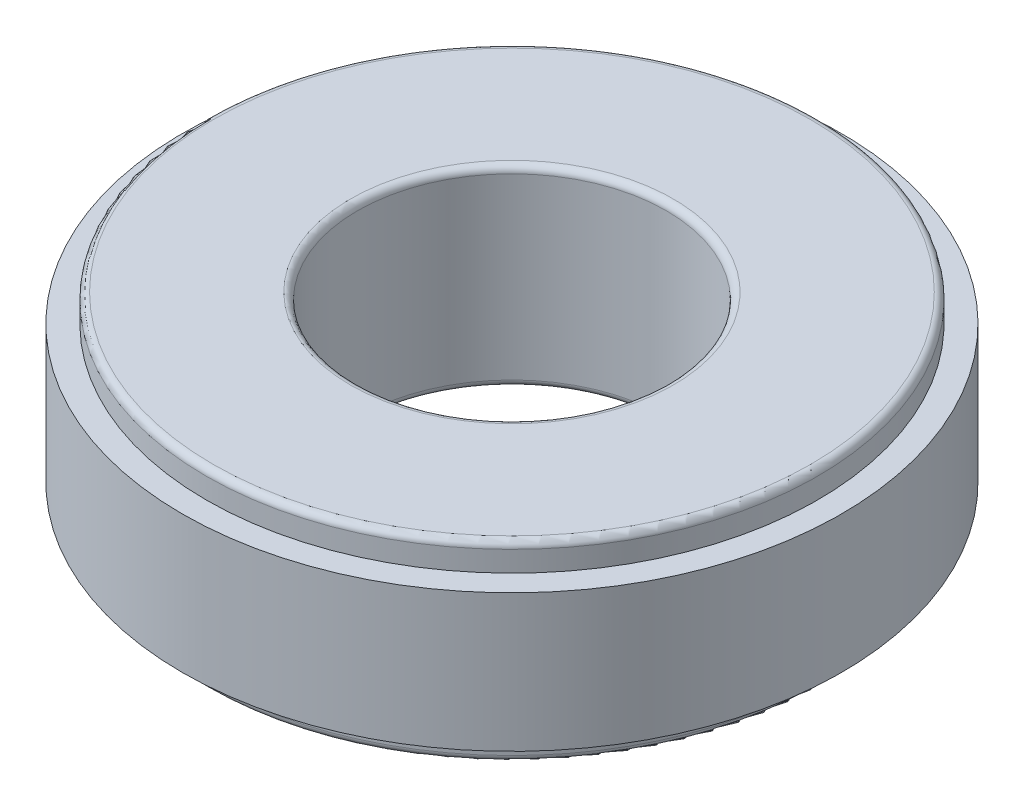
ISO-10303-21;
HEADER;
FILE_DESCRIPTION(('STEP AP214'),'2;1');
FILE_NAME('part.step','',(''),(''),'','','');
FILE_SCHEMA(('AUTOMOTIVE_DESIGN { 1 0 10303 214 1 1 1 1 }'));
ENDSEC;
DATA;
#1=APPLICATION_CONTEXT('core data for automotive mechanical design processes');
#2=APPLICATION_PROTOCOL_DEFINITION('international standard','automotive_design',2000,#1);
#3=PRODUCT_CONTEXT('',#1,'mechanical');
#4=PRODUCT('Part','Part','',(#3));
#5=PRODUCT_RELATED_PRODUCT_CATEGORY('part','',(#4));
#6=PRODUCT_DEFINITION_FORMATION('','',#4);
#7=PRODUCT_DEFINITION_CONTEXT('part definition',#1,'design');
#8=PRODUCT_DEFINITION('design','',#6,#7);
#9=PRODUCT_DEFINITION_SHAPE('','',#8);
#10=(LENGTH_UNIT() NAMED_UNIT(*) SI_UNIT(.MILLI.,.METRE.));
#11=(NAMED_UNIT(*) PLANE_ANGLE_UNIT() SI_UNIT($,.RADIAN.));
#12=(NAMED_UNIT(*) SI_UNIT($,.STERADIAN.) SOLID_ANGLE_UNIT());
#13=UNCERTAINTY_MEASURE_WITH_UNIT(LENGTH_MEASURE(1.E-05),#10,'distance_accuracy_value','');
#14=(GEOMETRIC_REPRESENTATION_CONTEXT(3) GLOBAL_UNCERTAINTY_ASSIGNED_CONTEXT((#13)) GLOBAL_UNIT_ASSIGNED_CONTEXT((#10,
#11,#12)) REPRESENTATION_CONTEXT('',''));
#15=CARTESIAN_POINT('',(0.,0.,0.));
#16=DIRECTION('',(0.,0.,1.));
#17=DIRECTION('',(1.,0.,0.));
#18=AXIS2_PLACEMENT_3D('',#15,#16,#17);
#19=CARTESIAN_POINT('',(0.,2.54,0.));
#20=DIRECTION('',(0.,-1.,0.));
#21=DIRECTION('',(0.,0.,-1.));
#22=AXIS2_PLACEMENT_3D('',#19,#20,#21);
#23=CYLINDRICAL_SURFACE('',#22,28.2575);
#24=CARTESIAN_POINT('',(0.,0.635,0.));
#25=DIRECTION('',(0.,1.,0.));
#26=DIRECTION('',(0.,0.,1.));
#27=AXIS2_PLACEMENT_3D('',#24,#25,#26);
#28=CIRCLE('',#27,28.2575);
#29=CARTESIAN_POINT('',(0.,0.635,28.2575));
#30=VERTEX_POINT('',#29);
#31=EDGE_CURVE('E10',#30,#30,#28,.T.);
#32=ORIENTED_EDGE('',*,*,#31,.T.);
#33=EDGE_LOOP('',(#32));
#34=FACE_BOUND('',#33,.T.);
#35=CARTESIAN_POINT('',(0.,2.54,0.));
#36=DIRECTION('',(0.,1.,0.));
#37=DIRECTION('',(0.,0.,1.));
#38=AXIS2_PLACEMENT_3D('',#35,#36,#37);
#39=CIRCLE('',#38,28.2575);
#40=CARTESIAN_POINT('',(0.,2.54,28.2575));
#41=VERTEX_POINT('',#40);
#42=EDGE_CURVE('E64',#41,#41,#39,.T.);
#43=ORIENTED_EDGE('',*,*,#42,.F.);
#44=EDGE_LOOP('',(#43));
#45=FACE_BOUND('',#44,.T.);
#46=ADVANCED_FACE('F31',(#34,#45),#23,.T.);
#47=CARTESIAN_POINT('',(0.,0.,0.));
#48=DIRECTION('',(0.,1.,0.));
#49=DIRECTION('',(0.,0.,1.));
#50=AXIS2_PLACEMENT_3D('',#47,#48,#49);
#51=PLANE('',#50);
#52=CARTESIAN_POINT('',(0.,0.,0.));
#53=DIRECTION('',(0.,1.,0.));
#54=DIRECTION('',(0.,0.,1.));
#55=AXIS2_PLACEMENT_3D('',#52,#53,#54);
#56=CIRCLE('',#55,14.9225);
#57=CARTESIAN_POINT('',(0.,0.,14.9225));
#58=VERTEX_POINT('',#57);
#59=EDGE_CURVE('E57',#58,#58,#56,.T.);
#60=ORIENTED_EDGE('',*,*,#59,.T.);
#61=EDGE_LOOP('',(#60));
#62=FACE_BOUND('',#61,.T.);
#63=CARTESIAN_POINT('',(0.,0.,0.));
#64=DIRECTION('',(0.,1.,0.));
#65=DIRECTION('',(0.,0.,1.));
#66=AXIS2_PLACEMENT_3D('',#63,#64,#65);
#67=CIRCLE('',#66,27.6225);
#68=CARTESIAN_POINT('',(0.,0.,27.6225));
#69=VERTEX_POINT('',#68);
#70=EDGE_CURVE('E60',#69,#69,#67,.F.);
#71=ORIENTED_EDGE('',*,*,#70,.T.);
#72=EDGE_LOOP('',(#71));
#73=FACE_BOUND('',#72,.T.);
#74=ADVANCED_FACE('F88',(#62,#73),#51,.F.);
#75=CARTESIAN_POINT('',(0.,15.24,0.));
#76=DIRECTION('',(0.,-1.,0.));
#77=DIRECTION('',(0.,0.,-1.));
#78=AXIS2_PLACEMENT_3D('',#75,#76,#77);
#79=CYLINDRICAL_SURFACE('',#78,30.48);
#80=CARTESIAN_POINT('',(0.,15.24,0.));
#81=DIRECTION('',(0.,1.,0.));
#82=DIRECTION('',(0.,0.,1.));
#83=AXIS2_PLACEMENT_3D('',#80,#81,#82);
#84=CIRCLE('',#83,30.48);
#85=CARTESIAN_POINT('',(0.,15.24,30.48));
#86=VERTEX_POINT('',#85);
#87=EDGE_CURVE('E67',#86,#86,#84,.T.);
#88=ORIENTED_EDGE('',*,*,#87,.F.);
#89=EDGE_LOOP('',(#88));
#90=FACE_BOUND('',#89,.T.);
#91=CARTESIAN_POINT('',(0.,2.54,0.));
#92=DIRECTION('',(0.,1.,0.));
#93=DIRECTION('',(0.,0.,1.));
#94=AXIS2_PLACEMENT_3D('',#91,#92,#93);
#95=CIRCLE('',#94,30.48);
#96=CARTESIAN_POINT('',(0.,2.54,30.48));
#97=VERTEX_POINT('',#96);
#98=EDGE_CURVE('E68',#97,#97,#95,.T.);
#99=ORIENTED_EDGE('',*,*,#98,.T.);
#100=EDGE_LOOP('',(#99));
#101=FACE_BOUND('',#100,.T.);
#102=ADVANCED_FACE('F82',(#90,#101),#79,.T.);
#103=CARTESIAN_POINT('',(0.,15.24,0.));
#104=DIRECTION('',(0.,1.,0.));
#105=DIRECTION('',(0.,0.,1.));
#106=AXIS2_PLACEMENT_3D('',#103,#104,#105);
#107=PLANE('',#106);
#108=CARTESIAN_POINT('',(0.,15.24,0.));
#109=DIRECTION('',(0.,1.,0.));
#110=DIRECTION('',(0.,0.,1.));
#111=AXIS2_PLACEMENT_3D('',#108,#109,#110);
#112=CIRCLE('',#111,28.2575);
#113=CARTESIAN_POINT('',(0.,15.24,28.2575));
#114=VERTEX_POINT('',#113);
#115=EDGE_CURVE('E63',#114,#114,#112,.T.);
#116=ORIENTED_EDGE('',*,*,#115,.F.);
#117=EDGE_LOOP('',(#116));
#118=FACE_BOUND('',#117,.T.);
#119=ORIENTED_EDGE('',*,*,#87,.T.);
#120=EDGE_LOOP('',(#119));
#121=FACE_BOUND('',#120,.T.);
#122=ADVANCED_FACE('F78',(#118,#121),#107,.T.);
#123=CARTESIAN_POINT('',(0.,2.54,0.));
#124=DIRECTION('',(0.,1.,0.));
#125=DIRECTION('',(0.,0.,1.));
#126=AXIS2_PLACEMENT_3D('',#123,#124,#125);
#127=PLANE('',#126);
#128=ORIENTED_EDGE('',*,*,#42,.T.);
#129=EDGE_LOOP('',(#128));
#130=FACE_BOUND('',#129,.T.);
#131=ORIENTED_EDGE('',*,*,#98,.F.);
#132=EDGE_LOOP('',(#131));
#133=FACE_BOUND('',#132,.T.);
#134=ADVANCED_FACE('F81',(#130,#133),#127,.F.);
#135=CARTESIAN_POINT('',(0.,17.78,0.));
#136=DIRECTION('',(0.,-1.,0.));
#137=DIRECTION('',(0.,0.,-1.));
#138=AXIS2_PLACEMENT_3D('',#135,#136,#137);
#139=CYLINDRICAL_SURFACE('',#138,28.2575);
#140=CARTESIAN_POINT('',(0.,17.145,0.));
#141=DIRECTION('',(0.,1.,0.));
#142=DIRECTION('',(0.,0.,1.));
#143=AXIS2_PLACEMENT_3D('',#140,#141,#142);
#144=CIRCLE('',#143,28.2575);
#145=CARTESIAN_POINT('',(0.,17.145,28.2575));
#146=VERTEX_POINT('',#145);
#147=EDGE_CURVE('E38',#146,#146,#144,.F.);
#148=ORIENTED_EDGE('',*,*,#147,.T.);
#149=EDGE_LOOP('',(#148));
#150=FACE_BOUND('',#149,.T.);
#151=ORIENTED_EDGE('',*,*,#115,.T.);
#152=EDGE_LOOP('',(#151));
#153=FACE_BOUND('',#152,.T.);
#154=ADVANCED_FACE('F76',(#150,#153),#139,.T.);
#155=CARTESIAN_POINT('',(0.,17.78,0.));
#156=DIRECTION('',(0.,1.,0.));
#157=DIRECTION('',(0.,0.,1.));
#158=AXIS2_PLACEMENT_3D('',#155,#156,#157);
#159=PLANE('',#158);
#160=CARTESIAN_POINT('',(0.,17.78,0.));
#161=DIRECTION('',(0.,1.,0.));
#162=DIRECTION('',(0.,0.,1.));
#163=AXIS2_PLACEMENT_3D('',#160,#161,#162);
#164=CIRCLE('',#163,14.9225);
#165=CARTESIAN_POINT('',(0.,17.78,14.9225));
#166=VERTEX_POINT('',#165);
#167=EDGE_CURVE('E42',#166,#166,#164,.F.);
#168=ORIENTED_EDGE('',*,*,#167,.T.);
#169=EDGE_LOOP('',(#168));
#170=FACE_BOUND('',#169,.T.);
#171=CARTESIAN_POINT('',(0.,17.78,0.));
#172=DIRECTION('',(0.,1.,0.));
#173=DIRECTION('',(0.,0.,1.));
#174=AXIS2_PLACEMENT_3D('',#171,#172,#173);
#175=CIRCLE('',#174,27.6225);
#176=CARTESIAN_POINT('',(0.,17.78,27.6225));
#177=VERTEX_POINT('',#176);
#178=EDGE_CURVE('E46',#177,#177,#175,.T.);
#179=ORIENTED_EDGE('',*,*,#178,.T.);
#180=EDGE_LOOP('',(#179));
#181=FACE_BOUND('',#180,.T.);
#182=ADVANCED_FACE('F98',(#170,#181),#159,.T.);
#183=CARTESIAN_POINT('',(0.,0.,0.));
#184=DIRECTION('',(0.,1.,0.));
#185=DIRECTION('',(0.,0.,1.));
#186=AXIS2_PLACEMENT_3D('',#183,#184,#185);
#187=CYLINDRICAL_SURFACE('',#186,14.2875);
#188=CARTESIAN_POINT('',(0.,0.635,0.));
#189=DIRECTION('',(0.,1.,0.));
#190=DIRECTION('',(0.,0.,1.));
#191=AXIS2_PLACEMENT_3D('',#188,#189,#190);
#192=CIRCLE('',#191,14.2875);
#193=CARTESIAN_POINT('',(0.,0.635,14.2875));
#194=VERTEX_POINT('',#193);
#195=EDGE_CURVE('E51',#194,#194,#192,.F.);
#196=ORIENTED_EDGE('',*,*,#195,.T.);
#197=EDGE_LOOP('',(#196));
#198=FACE_BOUND('',#197,.T.);
#199=CARTESIAN_POINT('',(0.,17.145,0.));
#200=DIRECTION('',(0.,1.,0.));
#201=DIRECTION('',(0.,0.,1.));
#202=AXIS2_PLACEMENT_3D('',#199,#200,#201);
#203=CIRCLE('',#202,14.2875);
#204=CARTESIAN_POINT('',(0.,17.145,14.2875));
#205=VERTEX_POINT('',#204);
#206=EDGE_CURVE('E54',#205,#205,#203,.T.);
#207=ORIENTED_EDGE('',*,*,#206,.T.);
#208=EDGE_LOOP('',(#207));
#209=FACE_BOUND('',#208,.T.);
#210=ADVANCED_FACE('F113',(#198,#209),#187,.F.);
#211=CARTESIAN_POINT('',(0.,0.635,0.));
#212=DIRECTION('',(0.,1.,0.));
#213=DIRECTION('',(0.,0.,1.));
#214=AXIS2_PLACEMENT_3D('',#211,#212,#213);
#215=TOROIDAL_SURFACE('',#214,14.9225,0.635);
#216=ORIENTED_EDGE('',*,*,#195,.F.);
#217=EDGE_LOOP('',(#216));
#218=FACE_BOUND('',#217,.T.);
#219=ORIENTED_EDGE('',*,*,#59,.F.);
#220=EDGE_LOOP('',(#219));
#221=FACE_BOUND('',#220,.T.);
#222=ADVANCED_FACE('F109',(#218,#221),#215,.T.);
#223=CARTESIAN_POINT('',(0.,17.145,0.));
#224=DIRECTION('',(0.,1.,0.));
#225=DIRECTION('',(0.,0.,1.));
#226=AXIS2_PLACEMENT_3D('',#223,#224,#225);
#227=TOROIDAL_SURFACE('',#226,14.9225,0.635);
#228=ORIENTED_EDGE('',*,*,#167,.F.);
#229=EDGE_LOOP('',(#228));
#230=FACE_BOUND('',#229,.T.);
#231=ORIENTED_EDGE('',*,*,#206,.F.);
#232=EDGE_LOOP('',(#231));
#233=FACE_BOUND('',#232,.T.);
#234=ADVANCED_FACE('F112',(#230,#233),#227,.T.);
#235=CARTESIAN_POINT('',(0.,17.145,0.));
#236=DIRECTION('',(0.,1.,0.));
#237=DIRECTION('',(0.,0.,1.));
#238=AXIS2_PLACEMENT_3D('',#235,#236,#237);
#239=TOROIDAL_SURFACE('',#238,27.6225,0.635);
#240=ORIENTED_EDGE('',*,*,#147,.F.);
#241=EDGE_LOOP('',(#240));
#242=FACE_BOUND('',#241,.T.);
#243=ORIENTED_EDGE('',*,*,#178,.F.);
#244=EDGE_LOOP('',(#243));
#245=FACE_BOUND('',#244,.T.);
#246=ADVANCED_FACE('F116',(#242,#245),#239,.T.);
#247=CARTESIAN_POINT('',(0.,0.635,0.));
#248=DIRECTION('',(0.,1.,0.));
#249=DIRECTION('',(0.,0.,1.));
#250=AXIS2_PLACEMENT_3D('',#247,#248,#249);
#251=TOROIDAL_SURFACE('',#250,27.6225,0.635);
#252=ORIENTED_EDGE('',*,*,#70,.F.);
#253=EDGE_LOOP('',(#252));
#254=FACE_BOUND('',#253,.T.);
#255=ORIENTED_EDGE('',*,*,#31,.F.);
#256=EDGE_LOOP('',(#255));
#257=FACE_BOUND('',#256,.T.);
#258=ADVANCED_FACE('F33',(#254,#257),#251,.T.);
#259=CLOSED_SHELL('',(#46,#74,#102,#122,#134,#154,#182,#210,#222,#234,#246,#258));
#260=MANIFOLD_SOLID_BREP('B2',#259);
#261=ADVANCED_BREP_SHAPE_REPRESENTATION('',(#18,#260),#14);
#262=SHAPE_DEFINITION_REPRESENTATION(#9,#261);
ENDSEC;
END-ISO-10303-21;
